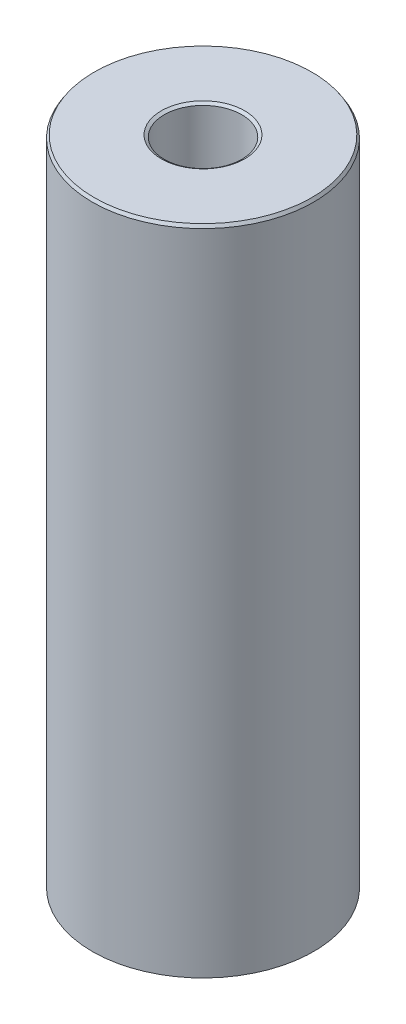
ISO-10303-21;
HEADER;
FILE_DESCRIPTION(('STEP AP214'),'2;1');
FILE_NAME('part.step','',(''),(''),'','','');
FILE_SCHEMA(('AUTOMOTIVE_DESIGN { 1 0 10303 214 1 1 1 1 }'));
ENDSEC;
DATA;
#1=APPLICATION_CONTEXT('core data for automotive mechanical design processes');
#2=APPLICATION_PROTOCOL_DEFINITION('international standard','automotive_design',2000,#1);
#3=PRODUCT_CONTEXT('',#1,'mechanical');
#4=PRODUCT('Part','Part','',(#3));
#5=PRODUCT_RELATED_PRODUCT_CATEGORY('part','',(#4));
#6=PRODUCT_DEFINITION_FORMATION('','',#4);
#7=PRODUCT_DEFINITION_CONTEXT('part definition',#1,'design');
#8=PRODUCT_DEFINITION('design','',#6,#7);
#9=PRODUCT_DEFINITION_SHAPE('','',#8);
#10=(LENGTH_UNIT() NAMED_UNIT(*) SI_UNIT(.MILLI.,.METRE.));
#11=(NAMED_UNIT(*) PLANE_ANGLE_UNIT() SI_UNIT($,.RADIAN.));
#12=(NAMED_UNIT(*) SI_UNIT($,.STERADIAN.) SOLID_ANGLE_UNIT());
#13=UNCERTAINTY_MEASURE_WITH_UNIT(LENGTH_MEASURE(1.E-05),#10,'distance_accuracy_value','');
#14=(GEOMETRIC_REPRESENTATION_CONTEXT(3) GLOBAL_UNCERTAINTY_ASSIGNED_CONTEXT((#13)) GLOBAL_UNIT_ASSIGNED_CONTEXT((#10,
#11,#12)) REPRESENTATION_CONTEXT('',''));
#15=CARTESIAN_POINT('',(0.,0.,0.));
#16=DIRECTION('',(0.,0.,1.));
#17=DIRECTION('',(1.,0.,0.));
#18=AXIS2_PLACEMENT_3D('',#15,#16,#17);
#19=CARTESIAN_POINT('',(0.,44.3036414480795,0.));
#20=DIRECTION('',(0.,-1.,0.));
#21=DIRECTION('',(0.,0.,-1.));
#22=AXIS2_PLACEMENT_3D('',#19,#20,#21);
#23=CYLINDRICAL_SURFACE('',#22,7.5);
#24=CARTESIAN_POINT('',(0.,0.12855755721216,0.));
#25=DIRECTION('',(0.,1.,0.));
#26=DIRECTION('',(0.,0.,1.));
#27=AXIS2_PLACEMENT_3D('',#24,#25,#26);
#28=CIRCLE('',#27,7.5);
#29=CARTESIAN_POINT('',(0.,0.12855755721216,7.5));
#30=VERTEX_POINT('',#29);
#31=EDGE_CURVE('E10',#30,#30,#28,.T.);
#32=ORIENTED_EDGE('',*,*,#31,.T.);
#33=EDGE_LOOP('',(#32));
#34=FACE_BOUND('',#33,.T.);
#35=CARTESIAN_POINT('',(0.,44.1022247595243,0.));
#36=DIRECTION('',(0.,1.,0.));
#37=DIRECTION('',(0.,0.,1.));
#38=AXIS2_PLACEMENT_3D('',#35,#36,#37);
#39=CIRCLE('',#38,7.5);
#40=CARTESIAN_POINT('',(0.,44.1022247595243,7.5));
#41=VERTEX_POINT('',#40);
#42=EDGE_CURVE('E50',#41,#41,#39,.F.);
#43=ORIENTED_EDGE('',*,*,#42,.T.);
#44=EDGE_LOOP('',(#43));
#45=FACE_BOUND('',#44,.T.);
#46=ADVANCED_FACE('F39',(#34,#45),#23,.T.);
#47=CARTESIAN_POINT('',(0.,44.3036414480795,0.));
#48=DIRECTION('',(0.,1.,0.));
#49=DIRECTION('',(0.,0.,1.));
#50=AXIS2_PLACEMENT_3D('',#47,#48,#49);
#51=PLANE('',#50);
#52=CARTESIAN_POINT('',(0.,44.3036414480795,0.));
#53=DIRECTION('',(0.,1.,0.));
#54=DIRECTION('',(0.,0.,1.));
#55=AXIS2_PLACEMENT_3D('',#52,#53,#54);
#56=CIRCLE('',#55,2.82599305275225);
#57=CARTESIAN_POINT('',(0.,44.3036414480795,2.82599305275225));
#58=VERTEX_POINT('',#57);
#59=EDGE_CURVE('E58',#58,#58,#56,.F.);
#60=ORIENTED_EDGE('',*,*,#59,.T.);
#61=EDGE_LOOP('',(#60));
#62=FACE_BOUND('',#61,.T.);
#63=CARTESIAN_POINT('',(0.,44.3036414480795,0.));
#64=DIRECTION('',(0.,1.,0.));
#65=DIRECTION('',(0.,0.,1.));
#66=AXIS2_PLACEMENT_3D('',#63,#64,#65);
#67=CIRCLE('',#66,7.37144244278784);
#68=CARTESIAN_POINT('',(0.,44.3036414480795,7.37144244278784));
#69=VERTEX_POINT('',#68);
#70=EDGE_CURVE('E61',#69,#69,#67,.T.);
#71=ORIENTED_EDGE('',*,*,#70,.T.);
#72=EDGE_LOOP('',(#71));
#73=FACE_BOUND('',#72,.T.);
#74=ADVANCED_FACE('F88',(#62,#73),#51,.T.);
#75=CARTESIAN_POINT('',(0.,0.,0.));
#76=DIRECTION('',(0.,1.,0.));
#77=DIRECTION('',(0.,0.,1.));
#78=AXIS2_PLACEMENT_3D('',#75,#76,#77);
#79=PLANE('',#78);
#80=CARTESIAN_POINT('',(0.,0.,0.));
#81=DIRECTION('',(0.,1.,0.));
#82=DIRECTION('',(0.,0.,1.));
#83=AXIS2_PLACEMENT_3D('',#80,#81,#82);
#84=CIRCLE('',#83,2.75313392140922);
#85=CARTESIAN_POINT('',(0.,0.,2.75313392140922));
#86=VERTEX_POINT('',#85);
#87=EDGE_CURVE('E51',#86,#86,#84,.T.);
#88=ORIENTED_EDGE('',*,*,#87,.T.);
#89=EDGE_LOOP('',(#88));
#90=FACE_BOUND('',#89,.T.);
#91=CARTESIAN_POINT('',(0.,0.,0.));
#92=DIRECTION('',(0.,1.,0.));
#93=DIRECTION('',(0.,0.,1.));
#94=AXIS2_PLACEMENT_3D('',#91,#92,#93);
#95=CIRCLE('',#94,7.2985833114448);
#96=CARTESIAN_POINT('',(0.,0.,7.2985833114448));
#97=VERTEX_POINT('',#96);
#98=EDGE_CURVE('E54',#97,#97,#95,.F.);
#99=ORIENTED_EDGE('',*,*,#98,.T.);
#100=EDGE_LOOP('',(#99));
#101=FACE_BOUND('',#100,.T.);
#102=ADVANCED_FACE('F83',(#90,#101),#79,.F.);
#103=CARTESIAN_POINT('',(0.,44.3036414480795,0.));
#104=DIRECTION('',(0.,-1.,0.));
#105=DIRECTION('',(0.,0.,-1.));
#106=AXIS2_PLACEMENT_3D('',#103,#104,#105);
#107=CYLINDRICAL_SURFACE('',#106,2.62457636419706);
#108=CARTESIAN_POINT('',(0.,44.1750838908673,0.));
#109=DIRECTION('',(0.,1.,0.));
#110=DIRECTION('',(0.,0.,1.));
#111=AXIS2_PLACEMENT_3D('',#108,#109,#110);
#112=CIRCLE('',#111,2.62457636419706);
#113=CARTESIAN_POINT('',(0.,44.1750838908673,2.62457636419706));
#114=VERTEX_POINT('',#113);
#115=EDGE_CURVE('E67',#114,#114,#112,.T.);
#116=ORIENTED_EDGE('',*,*,#115,.T.);
#117=EDGE_LOOP('',(#116));
#118=FACE_BOUND('',#117,.T.);
#119=CARTESIAN_POINT('',(0.,0.201416688555209,0.));
#120=DIRECTION('',(0.,1.,0.));
#121=DIRECTION('',(0.,0.,1.));
#122=AXIS2_PLACEMENT_3D('',#119,#120,#121);
#123=CIRCLE('',#122,2.62457636419706);
#124=CARTESIAN_POINT('',(0.,0.201416688555209,2.62457636419706));
#125=VERTEX_POINT('',#124);
#126=EDGE_CURVE('E69',#125,#125,#123,.F.);
#127=ORIENTED_EDGE('',*,*,#126,.T.);
#128=EDGE_LOOP('',(#127));
#129=FACE_BOUND('',#128,.T.);
#130=ADVANCED_FACE('F71',(#118,#129),#107,.F.);
#131=CARTESIAN_POINT('',(0.,44.1750838908673,0.));
#132=DIRECTION('',(0.,1.,0.));
#133=DIRECTION('',(0.,0.,1.));
#134=AXIS2_PLACEMENT_3D('',#131,#132,#133);
#135=CONICAL_SURFACE('',#134,2.62457636419706,1.00271377106634);
#136=ORIENTED_EDGE('',*,*,#59,.F.);
#137=EDGE_LOOP('',(#136));
#138=FACE_BOUND('',#137,.T.);
#139=ORIENTED_EDGE('',*,*,#115,.F.);
#140=EDGE_LOOP('',(#139));
#141=FACE_BOUND('',#140,.T.);
#142=ADVANCED_FACE('F77',(#138,#141),#135,.F.);
#143=CARTESIAN_POINT('',(0.,0.,0.));
#144=DIRECTION('',(0.,-1.,0.));
#145=DIRECTION('',(0.,0.,-1.));
#146=AXIS2_PLACEMENT_3D('',#143,#144,#145);
#147=CONICAL_SURFACE('',#146,2.75313392140922,0.568082555728496);
#148=ORIENTED_EDGE('',*,*,#126,.F.);
#149=EDGE_LOOP('',(#148));
#150=FACE_BOUND('',#149,.T.);
#151=ORIENTED_EDGE('',*,*,#87,.F.);
#152=EDGE_LOOP('',(#151));
#153=FACE_BOUND('',#152,.T.);
#154=ADVANCED_FACE('F73',(#150,#153),#147,.F.);
#155=CARTESIAN_POINT('',(0.,0.12855755721216,0.));
#156=DIRECTION('',(0.,1.,0.));
#157=DIRECTION('',(0.,0.,1.));
#158=AXIS2_PLACEMENT_3D('',#155,#156,#157);
#159=CONICAL_SURFACE('',#158,7.5,1.00271377106637);
#160=ORIENTED_EDGE('',*,*,#98,.F.);
#161=EDGE_LOOP('',(#160));
#162=FACE_BOUND('',#161,.T.);
#163=ORIENTED_EDGE('',*,*,#31,.F.);
#164=EDGE_LOOP('',(#163));
#165=FACE_BOUND('',#164,.T.);
#166=ADVANCED_FACE('F76',(#162,#165),#159,.T.);
#167=CARTESIAN_POINT('',(0.,44.3036414480795,0.));
#168=DIRECTION('',(0.,-1.,0.));
#169=DIRECTION('',(0.,0.,-1.));
#170=AXIS2_PLACEMENT_3D('',#167,#168,#169);
#171=CONICAL_SURFACE('',#170,7.37144244278784,0.568082555728499);
#172=ORIENTED_EDGE('',*,*,#42,.F.);
#173=EDGE_LOOP('',(#172));
#174=FACE_BOUND('',#173,.T.);
#175=ORIENTED_EDGE('',*,*,#70,.F.);
#176=EDGE_LOOP('',(#175));
#177=FACE_BOUND('',#176,.T.);
#178=ADVANCED_FACE('F45',(#174,#177),#171,.T.);
#179=CLOSED_SHELL('',(#46,#74,#102,#130,#142,#154,#166,#178));
#180=MANIFOLD_SOLID_BREP('B2',#179);
#181=ADVANCED_BREP_SHAPE_REPRESENTATION('',(#18,#180),#14);
#182=SHAPE_DEFINITION_REPRESENTATION(#9,#181);
ENDSEC;
END-ISO-10303-21;
